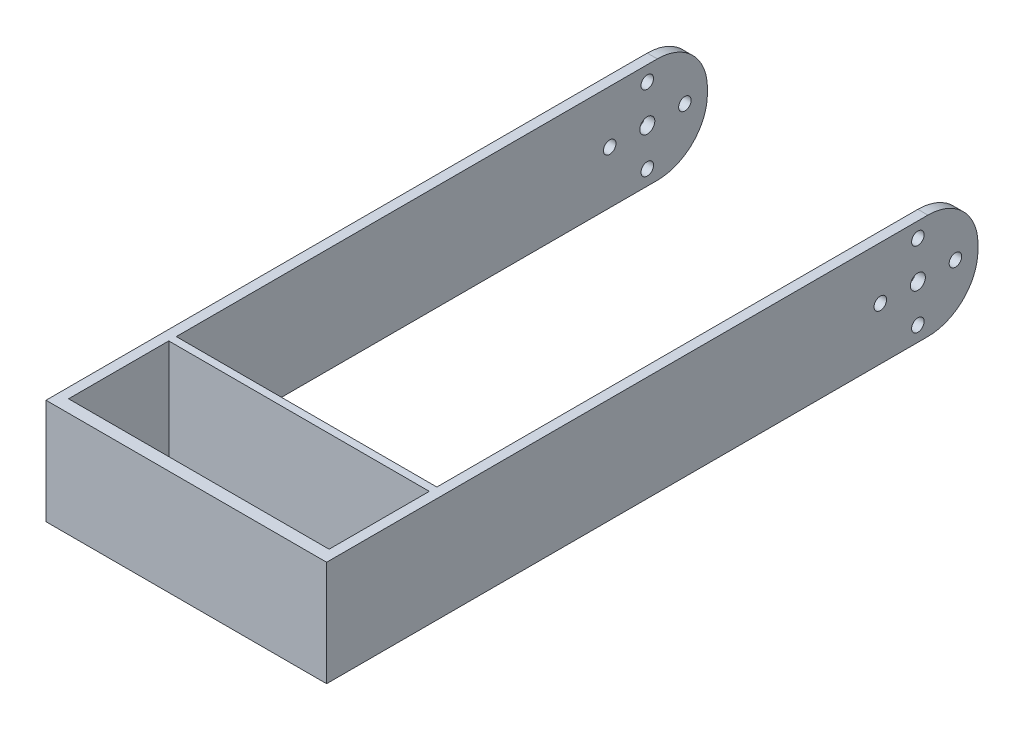
ISO-10303-21;
HEADER;
FILE_DESCRIPTION(('STEP AP214'),'2;1');
FILE_NAME('part.step','',(''),(''),'','','');
FILE_SCHEMA(('AUTOMOTIVE_DESIGN { 1 0 10303 214 1 1 1 1 }'));
ENDSEC;
DATA;
#1=APPLICATION_CONTEXT('core data for automotive mechanical design processes');
#2=APPLICATION_PROTOCOL_DEFINITION('international standard','automotive_design',2000,#1);
#3=PRODUCT_CONTEXT('',#1,'mechanical');
#4=PRODUCT('Part','Part','',(#3));
#5=PRODUCT_RELATED_PRODUCT_CATEGORY('part','',(#4));
#6=PRODUCT_DEFINITION_FORMATION('','',#4);
#7=PRODUCT_DEFINITION_CONTEXT('part definition',#1,'design');
#8=PRODUCT_DEFINITION('design','',#6,#7);
#9=PRODUCT_DEFINITION_SHAPE('','',#8);
#10=(LENGTH_UNIT() NAMED_UNIT(*) SI_UNIT(.MILLI.,.METRE.));
#11=(NAMED_UNIT(*) PLANE_ANGLE_UNIT() SI_UNIT($,.RADIAN.));
#12=(NAMED_UNIT(*) SI_UNIT($,.STERADIAN.) SOLID_ANGLE_UNIT());
#13=UNCERTAINTY_MEASURE_WITH_UNIT(LENGTH_MEASURE(1.E-05),#10,'distance_accuracy_value','');
#14=(GEOMETRIC_REPRESENTATION_CONTEXT(3) GLOBAL_UNCERTAINTY_ASSIGNED_CONTEXT((#13)) GLOBAL_UNIT_ASSIGNED_CONTEXT((#10,
#11,#12)) REPRESENTATION_CONTEXT('',''));
#15=CARTESIAN_POINT('',(0.,0.,0.));
#16=DIRECTION('',(0.,0.,1.));
#17=DIRECTION('',(1.,0.,0.));
#18=AXIS2_PLACEMENT_3D('',#15,#16,#17);
#19=CARTESIAN_POINT('',(0.,0.,0.));
#20=DIRECTION('',(0.,0.,1.));
#21=DIRECTION('',(1.,0.,0.));
#22=AXIS2_PLACEMENT_3D('',#19,#20,#21);
#23=PLANE('',#22);
#24=DIRECTION('',(0.,-1.,0.));
#25=VECTOR('',#24,1.);
#26=CARTESIAN_POINT('',(-28.,10.5,0.));
#27=LINE('',#26,#25);
#28=CARTESIAN_POINT('',(-28.,0.500000000000007,0.));
#29=VERTEX_POINT('',#28);
#30=CARTESIAN_POINT('',(-28.,-0.499999999999994,0.));
#31=VERTEX_POINT('',#30);
#32=EDGE_CURVE('E223',#29,#31,#27,.T.);
#33=ORIENTED_EDGE('',*,*,#32,.F.);
#34=DIRECTION('',(-1.,0.,0.));
#35=VECTOR('',#34,1.);
#36=CARTESIAN_POINT('',(0.,0.500000000000004,0.));
#37=LINE('',#36,#35);
#38=CARTESIAN_POINT('',(-26.,0.500000000000007,0.));
#39=VERTEX_POINT('',#38);
#40=EDGE_CURVE('E54',#29,#39,#37,.F.);
#41=ORIENTED_EDGE('',*,*,#40,.T.);
#42=DIRECTION('',(0.,-1.,0.));
#43=VECTOR('',#42,1.);
#44=CARTESIAN_POINT('',(-26.,10.5,0.));
#45=LINE('',#44,#43);
#46=CARTESIAN_POINT('',(-26.,-0.499999999999994,0.));
#47=VERTEX_POINT('',#46);
#48=EDGE_CURVE('E181',#39,#47,#45,.T.);
#49=ORIENTED_EDGE('',*,*,#48,.T.);
#50=DIRECTION('',(1.,0.,0.));
#51=VECTOR('',#50,1.);
#52=CARTESIAN_POINT('',(0.,-0.499999999999997,0.));
#53=LINE('',#52,#51);
#54=EDGE_CURVE('E290',#47,#31,#53,.F.);
#55=ORIENTED_EDGE('',*,*,#54,.T.);
#56=EDGE_LOOP('',(#33,#41,#49,#55));
#57=FACE_BOUND('',#56,.T.);
#58=ADVANCED_FACE('F33',(#57),#23,.F.);
#59=CARTESIAN_POINT('',(28.,10.5,130.));
#60=DIRECTION('',(-1.,0.,0.));
#61=DIRECTION('',(0.,0.,1.));
#62=AXIS2_PLACEMENT_3D('',#59,#60,#61);
#63=PLANE('',#62);
#64=CARTESIAN_POINT('',(28.,0.,4.5));
#65=DIRECTION('',(1.,0.,0.));
#66=DIRECTION('',(0.,0.,-1.));
#67=AXIS2_PLACEMENT_3D('',#64,#65,#66);
#68=CIRCLE('',#67,1.25);
#69=CARTESIAN_POINT('',(28.,0.,3.25));
#70=VERTEX_POINT('',#69);
#71=EDGE_CURVE('E600',#70,#70,#68,.T.);
#72=ORIENTED_EDGE('',*,*,#71,.F.);
#73=EDGE_LOOP('',(#72));
#74=FACE_BOUND('',#73,.T.);
#75=CARTESIAN_POINT('',(28.,0.,19.5));
#76=DIRECTION('',(1.,0.,0.));
#77=DIRECTION('',(0.,0.,1.));
#78=AXIS2_PLACEMENT_3D('',#75,#76,#77);
#79=CIRCLE('',#78,1.25);
#80=CARTESIAN_POINT('',(28.,0.,20.75));
#81=VERTEX_POINT('',#80);
#82=EDGE_CURVE('E626',#81,#81,#79,.T.);
#83=ORIENTED_EDGE('',*,*,#82,.F.);
#84=EDGE_LOOP('',(#83));
#85=FACE_BOUND('',#84,.T.);
#86=CARTESIAN_POINT('',(28.,7.5,12.));
#87=DIRECTION('',(1.,0.,0.));
#88=DIRECTION('',(0.,0.,-1.));
#89=AXIS2_PLACEMENT_3D('',#86,#87,#88);
#90=CIRCLE('',#89,1.25);
#91=CARTESIAN_POINT('',(28.,7.5,10.75));
#92=VERTEX_POINT('',#91);
#93=EDGE_CURVE('E641',#92,#92,#90,.T.);
#94=ORIENTED_EDGE('',*,*,#93,.F.);
#95=EDGE_LOOP('',(#94));
#96=FACE_BOUND('',#95,.T.);
#97=CARTESIAN_POINT('',(28.,-7.5,12.));
#98=DIRECTION('',(1.,0.,0.));
#99=DIRECTION('',(0.,0.,1.));
#100=AXIS2_PLACEMENT_3D('',#97,#98,#99);
#101=CIRCLE('',#100,1.25);
#102=CARTESIAN_POINT('',(28.,-7.5,13.25));
#103=VERTEX_POINT('',#102);
#104=EDGE_CURVE('E635',#103,#103,#101,.T.);
#105=ORIENTED_EDGE('',*,*,#104,.F.);
#106=EDGE_LOOP('',(#105));
#107=FACE_BOUND('',#106,.T.);
#108=CARTESIAN_POINT('',(28.,0.,12.));
#109=DIRECTION('',(1.,0.,0.));
#110=DIRECTION('',(0.,0.,-1.));
#111=AXIS2_PLACEMENT_3D('',#108,#109,#110);
#112=CIRCLE('',#111,1.5);
#113=CARTESIAN_POINT('',(28.,0.,10.5));
#114=VERTEX_POINT('',#113);
#115=EDGE_CURVE('E591',#114,#114,#112,.T.);
#116=ORIENTED_EDGE('',*,*,#115,.F.);
#117=EDGE_LOOP('',(#116));
#118=FACE_BOUND('',#117,.T.);
#119=DIRECTION('',(0.,1.,0.));
#120=VECTOR('',#119,1.);
#121=CARTESIAN_POINT('',(28.,10.5,0.));
#122=LINE('',#121,#120);
#123=CARTESIAN_POINT('',(28.,-0.499999999999994,0.));
#124=VERTEX_POINT('',#123);
#125=CARTESIAN_POINT('',(28.,0.500000000000007,0.));
#126=VERTEX_POINT('',#125);
#127=EDGE_CURVE('E183',#124,#126,#122,.T.);
#128=ORIENTED_EDGE('',*,*,#127,.T.);
#129=CARTESIAN_POINT('',(28.,0.500000000000004,9.99999999999999));
#130=DIRECTION('',(-1.,0.,0.));
#131=DIRECTION('',(0.,0.,1.));
#132=AXIS2_PLACEMENT_3D('',#129,#130,#131);
#133=CIRCLE('',#132,10.);
#134=CARTESIAN_POINT('',(28.,10.5,9.99999999999999));
#135=VERTEX_POINT('',#134);
#136=EDGE_CURVE('E278',#126,#135,#133,.F.);
#137=ORIENTED_EDGE('',*,*,#136,.T.);
#138=DIRECTION('',(0.,0.,-1.));
#139=VECTOR('',#138,1.);
#140=CARTESIAN_POINT('',(28.,10.5,130.));
#141=LINE('',#140,#139);
#142=CARTESIAN_POINT('',(28.,10.5,130.));
#143=VERTEX_POINT('',#142);
#144=EDGE_CURVE('E242',#143,#135,#141,.T.);
#145=ORIENTED_EDGE('',*,*,#144,.F.);
#146=DIRECTION('',(0.,1.,0.));
#147=VECTOR('',#146,1.);
#148=CARTESIAN_POINT('',(28.,10.5,130.));
#149=LINE('',#148,#147);
#150=CARTESIAN_POINT('',(28.,-10.5,130.));
#151=VERTEX_POINT('',#150);
#152=EDGE_CURVE('E219',#151,#143,#149,.T.);
#153=ORIENTED_EDGE('',*,*,#152,.F.);
#154=DIRECTION('',(0.,0.,-1.));
#155=VECTOR('',#154,1.);
#156=CARTESIAN_POINT('',(28.,-10.5,130.));
#157=LINE('',#156,#155);
#158=CARTESIAN_POINT('',(28.,-10.5,9.99999999999999));
#159=VERTEX_POINT('',#158);
#160=EDGE_CURVE('E229',#151,#159,#157,.T.);
#161=ORIENTED_EDGE('',*,*,#160,.T.);
#162=CARTESIAN_POINT('',(28.,-0.499999999999997,9.99999999999999));
#163=DIRECTION('',(-1.,0.,0.));
#164=DIRECTION('',(0.,0.,1.));
#165=AXIS2_PLACEMENT_3D('',#162,#163,#164);
#166=CIRCLE('',#165,10.);
#167=EDGE_CURVE('E276',#159,#124,#166,.F.);
#168=ORIENTED_EDGE('',*,*,#167,.T.);
#169=EDGE_LOOP('',(#128,#137,#145,#153,#161,#168));
#170=FACE_BOUND('',#169,.T.);
#171=ADVANCED_FACE('F312',(#74,#85,#96,#107,#118,#170),#63,.F.);
#172=CARTESIAN_POINT('',(-28.,10.5,130.));
#173=DIRECTION('',(0.,-1.,0.));
#174=DIRECTION('',(0.,0.,-1.));
#175=AXIS2_PLACEMENT_3D('',#172,#173,#174);
#176=PLANE('',#175);
#177=DIRECTION('',(0.,0.,1.));
#178=VECTOR('',#177,1.);
#179=CARTESIAN_POINT('',(26.,10.5,107.5));
#180=LINE('',#179,#178);
#181=CARTESIAN_POINT('',(26.,10.5,107.5));
#182=VERTEX_POINT('',#181);
#183=CARTESIAN_POINT('',(26.,10.5,127.5));
#184=VERTEX_POINT('',#183);
#185=EDGE_CURVE('E197',#182,#184,#180,.T.);
#186=ORIENTED_EDGE('',*,*,#185,.T.);
#187=DIRECTION('',(-1.,0.,0.));
#188=VECTOR('',#187,1.);
#189=CARTESIAN_POINT('',(26.,10.5,127.5));
#190=LINE('',#189,#188);
#191=CARTESIAN_POINT('',(-26.,10.5,127.5));
#192=VERTEX_POINT('',#191);
#193=EDGE_CURVE('E187',#184,#192,#190,.T.);
#194=ORIENTED_EDGE('',*,*,#193,.T.);
#195=DIRECTION('',(0.,0.,-1.));
#196=VECTOR('',#195,1.);
#197=CARTESIAN_POINT('',(-26.,10.5,127.5));
#198=LINE('',#197,#196);
#199=CARTESIAN_POINT('',(-26.,10.5,107.5));
#200=VERTEX_POINT('',#199);
#201=EDGE_CURVE('E190',#192,#200,#198,.T.);
#202=ORIENTED_EDGE('',*,*,#201,.T.);
#203=DIRECTION('',(1.,0.,0.));
#204=VECTOR('',#203,1.);
#205=CARTESIAN_POINT('',(-26.,10.5,107.5));
#206=LINE('',#205,#204);
#207=EDGE_CURVE('E194',#200,#182,#206,.T.);
#208=ORIENTED_EDGE('',*,*,#207,.T.);
#209=EDGE_LOOP('',(#186,#194,#202,#208));
#210=FACE_BOUND('',#209,.T.);
#211=ORIENTED_EDGE('',*,*,#144,.T.);
#212=DIRECTION('',(-1.,0.,0.));
#213=VECTOR('',#212,1.);
#214=CARTESIAN_POINT('',(-28.,10.5,9.99999999999999));
#215=LINE('',#214,#213);
#216=CARTESIAN_POINT('',(26.,10.5,9.99999999999999));
#217=VERTEX_POINT('',#216);
#218=EDGE_CURVE('E154',#135,#217,#215,.T.);
#219=ORIENTED_EDGE('',*,*,#218,.T.);
#220=DIRECTION('',(0.,0.,1.));
#221=VECTOR('',#220,1.);
#222=CARTESIAN_POINT('',(26.,10.5,0.));
#223=LINE('',#222,#221);
#224=CARTESIAN_POINT('',(26.,10.5,106.));
#225=VERTEX_POINT('',#224);
#226=EDGE_CURVE('E146',#217,#225,#223,.T.);
#227=ORIENTED_EDGE('',*,*,#226,.T.);
#228=DIRECTION('',(-1.,0.,0.));
#229=VECTOR('',#228,1.);
#230=CARTESIAN_POINT('',(-26.,10.5,106.));
#231=LINE('',#230,#229);
#232=CARTESIAN_POINT('',(-26.,10.5,106.));
#233=VERTEX_POINT('',#232);
#234=EDGE_CURVE('E152',#225,#233,#231,.T.);
#235=ORIENTED_EDGE('',*,*,#234,.T.);
#236=DIRECTION('',(0.,0.,-1.));
#237=VECTOR('',#236,1.);
#238=CARTESIAN_POINT('',(-26.,10.5,106.));
#239=LINE('',#238,#237);
#240=CARTESIAN_POINT('',(-26.,10.5,9.99999999999999));
#241=VERTEX_POINT('',#240);
#242=EDGE_CURVE('E171',#233,#241,#239,.T.);
#243=ORIENTED_EDGE('',*,*,#242,.T.);
#244=DIRECTION('',(-1.,0.,0.));
#245=VECTOR('',#244,1.);
#246=CARTESIAN_POINT('',(-28.,10.5,9.99999999999999));
#247=LINE('',#246,#245);
#248=CARTESIAN_POINT('',(-28.,10.5,9.99999999999999));
#249=VERTEX_POINT('',#248);
#250=EDGE_CURVE('E244',#241,#249,#247,.T.);
#251=ORIENTED_EDGE('',*,*,#250,.T.);
#252=DIRECTION('',(0.,0.,-1.));
#253=VECTOR('',#252,1.);
#254=CARTESIAN_POINT('',(-28.,10.5,130.));
#255=LINE('',#254,#253);
#256=CARTESIAN_POINT('',(-28.,10.5,130.));
#257=VERTEX_POINT('',#256);
#258=EDGE_CURVE('E239',#257,#249,#255,.T.);
#259=ORIENTED_EDGE('',*,*,#258,.F.);
#260=DIRECTION('',(-1.,0.,0.));
#261=VECTOR('',#260,1.);
#262=CARTESIAN_POINT('',(-28.,10.5,130.));
#263=LINE('',#262,#261);
#264=EDGE_CURVE('E222',#143,#257,#263,.T.);
#265=ORIENTED_EDGE('',*,*,#264,.F.);
#266=EDGE_LOOP('',(#211,#219,#227,#235,#243,#251,#259,#265));
#267=FACE_BOUND('',#266,.T.);
#268=ADVANCED_FACE('F149',(#210,#267),#176,.F.);
#269=CARTESIAN_POINT('',(-28.,10.5,130.));
#270=DIRECTION('',(1.,0.,0.));
#271=DIRECTION('',(0.,1.,0.));
#272=AXIS2_PLACEMENT_3D('',#269,#270,#271);
#273=PLANE('',#272);
#274=CARTESIAN_POINT('',(-28.,0.,4.5));
#275=DIRECTION('',(1.,0.,0.));
#276=DIRECTION('',(0.,0.,-1.));
#277=AXIS2_PLACEMENT_3D('',#274,#275,#276);
#278=CIRCLE('',#277,1.25);
#279=CARTESIAN_POINT('',(-28.,0.,3.25));
#280=VERTEX_POINT('',#279);
#281=EDGE_CURVE('E595',#280,#280,#278,.T.);
#282=ORIENTED_EDGE('',*,*,#281,.T.);
#283=EDGE_LOOP('',(#282));
#284=FACE_BOUND('',#283,.T.);
#285=CARTESIAN_POINT('',(-28.,0.,19.5));
#286=DIRECTION('',(1.,0.,0.));
#287=DIRECTION('',(0.,0.,1.));
#288=AXIS2_PLACEMENT_3D('',#285,#286,#287);
#289=CIRCLE('',#288,1.25);
#290=CARTESIAN_POINT('',(-28.,0.,20.75));
#291=VERTEX_POINT('',#290);
#292=EDGE_CURVE('E629',#291,#291,#289,.T.);
#293=ORIENTED_EDGE('',*,*,#292,.T.);
#294=EDGE_LOOP('',(#293));
#295=FACE_BOUND('',#294,.T.);
#296=CARTESIAN_POINT('',(-28.,7.5,12.));
#297=DIRECTION('',(1.,0.,0.));
#298=DIRECTION('',(0.,0.,-1.));
#299=AXIS2_PLACEMENT_3D('',#296,#297,#298);
#300=CIRCLE('',#299,1.25);
#301=CARTESIAN_POINT('',(-28.,7.5,10.75));
#302=VERTEX_POINT('',#301);
#303=EDGE_CURVE('E630',#302,#302,#300,.T.);
#304=ORIENTED_EDGE('',*,*,#303,.T.);
#305=EDGE_LOOP('',(#304));
#306=FACE_BOUND('',#305,.T.);
#307=CARTESIAN_POINT('',(-28.,-7.5,12.));
#308=DIRECTION('',(1.,0.,0.));
#309=DIRECTION('',(0.,0.,1.));
#310=AXIS2_PLACEMENT_3D('',#307,#308,#309);
#311=CIRCLE('',#310,1.25);
#312=CARTESIAN_POINT('',(-28.,-7.5,13.25));
#313=VERTEX_POINT('',#312);
#314=EDGE_CURVE('E638',#313,#313,#311,.T.);
#315=ORIENTED_EDGE('',*,*,#314,.T.);
#316=EDGE_LOOP('',(#315));
#317=FACE_BOUND('',#316,.T.);
#318=CARTESIAN_POINT('',(-28.,0.,12.));
#319=DIRECTION('',(1.,0.,0.));
#320=DIRECTION('',(0.,0.,-1.));
#321=AXIS2_PLACEMENT_3D('',#318,#319,#320);
#322=CIRCLE('',#321,1.5);
#323=CARTESIAN_POINT('',(-28.,0.,10.5));
#324=VERTEX_POINT('',#323);
#325=EDGE_CURVE('E249',#324,#324,#322,.T.);
#326=ORIENTED_EDGE('',*,*,#325,.T.);
#327=EDGE_LOOP('',(#326));
#328=FACE_BOUND('',#327,.T.);
#329=ORIENTED_EDGE('',*,*,#258,.T.);
#330=CARTESIAN_POINT('',(-28.,0.500000000000004,9.99999999999999));
#331=DIRECTION('',(1.,0.,0.));
#332=DIRECTION('',(0.,1.,0.));
#333=AXIS2_PLACEMENT_3D('',#330,#331,#332);
#334=CIRCLE('',#333,10.);
#335=EDGE_CURVE('E288',#249,#29,#334,.F.);
#336=ORIENTED_EDGE('',*,*,#335,.T.);
#337=ORIENTED_EDGE('',*,*,#32,.T.);
#338=CARTESIAN_POINT('',(-28.,-0.499999999999997,9.99999999999999));
#339=DIRECTION('',(1.,0.,0.));
#340=DIRECTION('',(0.,1.,0.));
#341=AXIS2_PLACEMENT_3D('',#338,#339,#340);
#342=CIRCLE('',#341,10.);
#343=CARTESIAN_POINT('',(-28.,-10.5,9.99999999999999));
#344=VERTEX_POINT('',#343);
#345=EDGE_CURVE('E286',#31,#344,#342,.F.);
#346=ORIENTED_EDGE('',*,*,#345,.T.);
#347=DIRECTION('',(0.,0.,-1.));
#348=VECTOR('',#347,1.);
#349=CARTESIAN_POINT('',(-28.,-10.5,130.));
#350=LINE('',#349,#348);
#351=CARTESIAN_POINT('',(-28.,-10.5,130.));
#352=VERTEX_POINT('',#351);
#353=EDGE_CURVE('E236',#352,#344,#350,.T.);
#354=ORIENTED_EDGE('',*,*,#353,.F.);
#355=DIRECTION('',(0.,-1.,0.));
#356=VECTOR('',#355,1.);
#357=CARTESIAN_POINT('',(-28.,10.5,130.));
#358=LINE('',#357,#356);
#359=EDGE_CURVE('E225',#257,#352,#358,.T.);
#360=ORIENTED_EDGE('',*,*,#359,.F.);
#361=EDGE_LOOP('',(#329,#336,#337,#346,#354,#360));
#362=FACE_BOUND('',#361,.T.);
#363=ADVANCED_FACE('F296',(#284,#295,#306,#317,#328,#362),#273,.F.);
#364=CARTESIAN_POINT('',(-28.,-10.5,130.));
#365=DIRECTION('',(0.,1.,0.));
#366=DIRECTION('',(0.,0.,1.));
#367=AXIS2_PLACEMENT_3D('',#364,#365,#366);
#368=PLANE('',#367);
#369=DIRECTION('',(0.,0.,-1.));
#370=VECTOR('',#369,1.);
#371=CARTESIAN_POINT('',(-26.,-10.5,127.5));
#372=LINE('',#371,#370);
#373=CARTESIAN_POINT('',(-26.,-10.5,127.5));
#374=VERTEX_POINT('',#373);
#375=CARTESIAN_POINT('',(-26.,-10.5,107.5));
#376=VERTEX_POINT('',#375);
#377=EDGE_CURVE('E203',#374,#376,#372,.T.);
#378=ORIENTED_EDGE('',*,*,#377,.F.);
#379=DIRECTION('',(-1.,0.,0.));
#380=VECTOR('',#379,1.);
#381=CARTESIAN_POINT('',(26.,-10.5,127.5));
#382=LINE('',#381,#380);
#383=CARTESIAN_POINT('',(26.,-10.5,127.5));
#384=VERTEX_POINT('',#383);
#385=EDGE_CURVE('E201',#384,#374,#382,.T.);
#386=ORIENTED_EDGE('',*,*,#385,.F.);
#387=DIRECTION('',(0.,0.,1.));
#388=VECTOR('',#387,1.);
#389=CARTESIAN_POINT('',(26.,-10.5,107.5));
#390=LINE('',#389,#388);
#391=CARTESIAN_POINT('',(26.,-10.5,107.5));
#392=VERTEX_POINT('',#391);
#393=EDGE_CURVE('E191',#392,#384,#390,.T.);
#394=ORIENTED_EDGE('',*,*,#393,.F.);
#395=DIRECTION('',(1.,0.,0.));
#396=VECTOR('',#395,1.);
#397=CARTESIAN_POINT('',(-26.,-10.5,107.5));
#398=LINE('',#397,#396);
#399=EDGE_CURVE('E207',#376,#392,#398,.T.);
#400=ORIENTED_EDGE('',*,*,#399,.F.);
#401=EDGE_LOOP('',(#378,#386,#394,#400));
#402=FACE_BOUND('',#401,.T.);
#403=DIRECTION('',(0.,0.,1.));
#404=VECTOR('',#403,1.);
#405=CARTESIAN_POINT('',(26.,-10.5,0.));
#406=LINE('',#405,#404);
#407=CARTESIAN_POINT('',(26.,-10.5,9.99999999999999));
#408=VERTEX_POINT('',#407);
#409=CARTESIAN_POINT('',(26.,-10.5,106.));
#410=VERTEX_POINT('',#409);
#411=EDGE_CURVE('E162',#408,#410,#406,.T.);
#412=ORIENTED_EDGE('',*,*,#411,.F.);
#413=DIRECTION('',(1.,0.,0.));
#414=VECTOR('',#413,1.);
#415=CARTESIAN_POINT('',(-28.,-10.5,9.99999999999999));
#416=LINE('',#415,#414);
#417=EDGE_CURVE('E283',#408,#159,#416,.T.);
#418=ORIENTED_EDGE('',*,*,#417,.T.);
#419=ORIENTED_EDGE('',*,*,#160,.F.);
#420=DIRECTION('',(1.,0.,0.));
#421=VECTOR('',#420,1.);
#422=CARTESIAN_POINT('',(-28.,-10.5,130.));
#423=LINE('',#422,#421);
#424=EDGE_CURVE('E227',#352,#151,#423,.T.);
#425=ORIENTED_EDGE('',*,*,#424,.F.);
#426=ORIENTED_EDGE('',*,*,#353,.T.);
#427=DIRECTION('',(1.,0.,0.));
#428=VECTOR('',#427,1.);
#429=CARTESIAN_POINT('',(-28.,-10.5,9.99999999999999));
#430=LINE('',#429,#428);
#431=CARTESIAN_POINT('',(-26.,-10.5,9.99999999999999));
#432=VERTEX_POINT('',#431);
#433=EDGE_CURVE('E280',#344,#432,#430,.T.);
#434=ORIENTED_EDGE('',*,*,#433,.T.);
#435=DIRECTION('',(0.,0.,-1.));
#436=VECTOR('',#435,1.);
#437=CARTESIAN_POINT('',(-26.,-10.5,106.));
#438=LINE('',#437,#436);
#439=CARTESIAN_POINT('',(-26.,-10.5,106.));
#440=VERTEX_POINT('',#439);
#441=EDGE_CURVE('E156',#440,#432,#438,.T.);
#442=ORIENTED_EDGE('',*,*,#441,.F.);
#443=DIRECTION('',(-1.,0.,0.));
#444=VECTOR('',#443,1.);
#445=CARTESIAN_POINT('',(-26.,-10.5,106.));
#446=LINE('',#445,#444);
#447=EDGE_CURVE('E177',#410,#440,#446,.T.);
#448=ORIENTED_EDGE('',*,*,#447,.F.);
#449=EDGE_LOOP('',(#412,#418,#419,#425,#426,#434,#442,#448));
#450=FACE_BOUND('',#449,.T.);
#451=ADVANCED_FACE('F301',(#402,#450),#368,.F.);
#452=CARTESIAN_POINT('',(0.,0.,130.));
#453=DIRECTION('',(0.,0.,1.));
#454=DIRECTION('',(1.,0.,0.));
#455=AXIS2_PLACEMENT_3D('',#452,#453,#454);
#456=PLANE('',#455);
#457=ORIENTED_EDGE('',*,*,#152,.T.);
#458=ORIENTED_EDGE('',*,*,#264,.T.);
#459=ORIENTED_EDGE('',*,*,#359,.T.);
#460=ORIENTED_EDGE('',*,*,#424,.T.);
#461=EDGE_LOOP('',(#457,#458,#459,#460));
#462=FACE_BOUND('',#461,.T.);
#463=ADVANCED_FACE('F325',(#462),#456,.T.);
#464=DIRECTION('',(0.,-1.,0.));
#465=VECTOR('',#464,1.);
#466=CARTESIAN_POINT('',(26.,10.5,0.));
#467=LINE('',#466,#465);
#468=CARTESIAN_POINT('',(26.,0.500000000000007,0.));
#469=VERTEX_POINT('',#468);
#470=CARTESIAN_POINT('',(26.,-0.499999999999994,0.));
#471=VERTEX_POINT('',#470);
#472=EDGE_CURVE('E167',#469,#471,#467,.T.);
#473=ORIENTED_EDGE('',*,*,#472,.F.);
#474=DIRECTION('',(-1.,0.,0.));
#475=VECTOR('',#474,1.);
#476=CARTESIAN_POINT('',(0.,0.500000000000004,0.));
#477=LINE('',#476,#475);
#478=EDGE_CURVE('E274',#469,#126,#477,.F.);
#479=ORIENTED_EDGE('',*,*,#478,.T.);
#480=ORIENTED_EDGE('',*,*,#127,.F.);
#481=DIRECTION('',(1.,0.,0.));
#482=VECTOR('',#481,1.);
#483=CARTESIAN_POINT('',(0.,-0.499999999999997,0.));
#484=LINE('',#483,#482);
#485=EDGE_CURVE('E272',#124,#471,#484,.F.);
#486=ORIENTED_EDGE('',*,*,#485,.T.);
#487=EDGE_LOOP('',(#473,#479,#480,#486));
#488=FACE_BOUND('',#487,.T.);
#489=ADVANCED_FACE('F317',(#488),#23,.F.);
#490=CARTESIAN_POINT('',(-26.,10.5,106.));
#491=DIRECTION('',(-1.,0.,0.));
#492=DIRECTION('',(0.,0.,1.));
#493=AXIS2_PLACEMENT_3D('',#490,#491,#492);
#494=PLANE('',#493);
#495=CARTESIAN_POINT('',(-26.,0.,4.5));
#496=DIRECTION('',(-1.,0.,0.));
#497=DIRECTION('',(0.,0.,1.));
#498=AXIS2_PLACEMENT_3D('',#495,#496,#497);
#499=CIRCLE('',#498,1.25);
#500=CARTESIAN_POINT('',(-26.,0.,5.75));
#501=VERTEX_POINT('',#500);
#502=EDGE_CURVE('E204',#501,#501,#499,.T.);
#503=ORIENTED_EDGE('',*,*,#502,.T.);
#504=EDGE_LOOP('',(#503));
#505=FACE_BOUND('',#504,.T.);
#506=CARTESIAN_POINT('',(-26.,0.,19.5));
#507=DIRECTION('',(-1.,0.,0.));
#508=DIRECTION('',(0.,0.,1.));
#509=AXIS2_PLACEMENT_3D('',#506,#507,#508);
#510=CIRCLE('',#509,1.25);
#511=CARTESIAN_POINT('',(-26.,0.,20.75));
#512=VERTEX_POINT('',#511);
#513=EDGE_CURVE('E261',#512,#512,#510,.T.);
#514=ORIENTED_EDGE('',*,*,#513,.T.);
#515=EDGE_LOOP('',(#514));
#516=FACE_BOUND('',#515,.T.);
#517=CARTESIAN_POINT('',(-26.,7.5,12.));
#518=DIRECTION('',(-1.,0.,0.));
#519=DIRECTION('',(0.,0.,1.));
#520=AXIS2_PLACEMENT_3D('',#517,#518,#519);
#521=CIRCLE('',#520,1.25);
#522=CARTESIAN_POINT('',(-26.,7.5,13.25));
#523=VERTEX_POINT('',#522);
#524=EDGE_CURVE('E257',#523,#523,#521,.T.);
#525=ORIENTED_EDGE('',*,*,#524,.T.);
#526=EDGE_LOOP('',(#525));
#527=FACE_BOUND('',#526,.T.);
#528=CARTESIAN_POINT('',(-26.,-7.5,12.));
#529=DIRECTION('',(-1.,0.,0.));
#530=DIRECTION('',(0.,0.,1.));
#531=AXIS2_PLACEMENT_3D('',#528,#529,#530);
#532=CIRCLE('',#531,1.25);
#533=CARTESIAN_POINT('',(-26.,-7.5,13.25));
#534=VERTEX_POINT('',#533);
#535=EDGE_CURVE('E253',#534,#534,#532,.T.);
#536=ORIENTED_EDGE('',*,*,#535,.T.);
#537=EDGE_LOOP('',(#536));
#538=FACE_BOUND('',#537,.T.);
#539=CARTESIAN_POINT('',(-26.,0.,12.));
#540=DIRECTION('',(-1.,0.,0.));
#541=DIRECTION('',(0.,0.,1.));
#542=AXIS2_PLACEMENT_3D('',#539,#540,#541);
#543=CIRCLE('',#542,1.5);
#544=CARTESIAN_POINT('',(-26.,0.,13.5));
#545=VERTEX_POINT('',#544);
#546=EDGE_CURVE('E248',#545,#545,#543,.T.);
#547=ORIENTED_EDGE('',*,*,#546,.T.);
#548=EDGE_LOOP('',(#547));
#549=FACE_BOUND('',#548,.T.);
#550=ORIENTED_EDGE('',*,*,#48,.F.);
#551=CARTESIAN_POINT('',(-26.,0.500000000000004,9.99999999999999));
#552=DIRECTION('',(-1.,0.,0.));
#553=DIRECTION('',(0.,0.,1.));
#554=AXIS2_PLACEMENT_3D('',#551,#552,#553);
#555=CIRCLE('',#554,10.);
#556=EDGE_CURVE('E11',#39,#241,#555,.F.);
#557=ORIENTED_EDGE('',*,*,#556,.T.);
#558=ORIENTED_EDGE('',*,*,#242,.F.);
#559=DIRECTION('',(0.,-1.,0.));
#560=VECTOR('',#559,1.);
#561=CARTESIAN_POINT('',(-26.,10.5,106.));
#562=LINE('',#561,#560);
#563=EDGE_CURVE('E166',#233,#440,#562,.T.);
#564=ORIENTED_EDGE('',*,*,#563,.T.);
#565=ORIENTED_EDGE('',*,*,#441,.T.);
#566=CARTESIAN_POINT('',(-26.,-0.499999999999997,9.99999999999999));
#567=DIRECTION('',(-1.,0.,0.));
#568=DIRECTION('',(0.,0.,1.));
#569=AXIS2_PLACEMENT_3D('',#566,#567,#568);
#570=CIRCLE('',#569,10.);
#571=EDGE_CURVE('E41',#432,#47,#570,.F.);
#572=ORIENTED_EDGE('',*,*,#571,.T.);
#573=EDGE_LOOP('',(#550,#557,#558,#564,#565,#572));
#574=FACE_BOUND('',#573,.T.);
#575=ADVANCED_FACE('F303',(#505,#516,#527,#538,#549,#574),#494,.F.);
#576=CARTESIAN_POINT('',(-26.,10.5,106.));
#577=DIRECTION('',(0.,0.,1.));
#578=DIRECTION('',(1.,0.,0.));
#579=AXIS2_PLACEMENT_3D('',#576,#577,#578);
#580=PLANE('',#579);
#581=ORIENTED_EDGE('',*,*,#447,.T.);
#582=ORIENTED_EDGE('',*,*,#563,.F.);
#583=ORIENTED_EDGE('',*,*,#234,.F.);
#584=DIRECTION('',(0.,-1.,0.));
#585=VECTOR('',#584,1.);
#586=CARTESIAN_POINT('',(26.,10.5,106.));
#587=LINE('',#586,#585);
#588=EDGE_CURVE('E159',#225,#410,#587,.T.);
#589=ORIENTED_EDGE('',*,*,#588,.T.);
#590=EDGE_LOOP('',(#581,#582,#583,#589));
#591=FACE_BOUND('',#590,.T.);
#592=ADVANCED_FACE('F169',(#591),#580,.F.);
#593=CARTESIAN_POINT('',(26.,10.5,0.));
#594=DIRECTION('',(1.,0.,0.));
#595=DIRECTION('',(0.,0.,-1.));
#596=AXIS2_PLACEMENT_3D('',#593,#594,#595);
#597=PLANE('',#596);
#598=CARTESIAN_POINT('',(26.,0.,4.5));
#599=DIRECTION('',(1.,0.,0.));
#600=DIRECTION('',(0.,0.,-1.));
#601=AXIS2_PLACEMENT_3D('',#598,#599,#600);
#602=CIRCLE('',#601,1.25);
#603=CARTESIAN_POINT('',(26.,0.,3.25));
#604=VERTEX_POINT('',#603);
#605=EDGE_CURVE('E262',#604,#604,#602,.T.);
#606=ORIENTED_EDGE('',*,*,#605,.T.);
#607=EDGE_LOOP('',(#606));
#608=FACE_BOUND('',#607,.T.);
#609=CARTESIAN_POINT('',(26.,0.,19.5));
#610=DIRECTION('',(1.,0.,0.));
#611=DIRECTION('',(0.,0.,-1.));
#612=AXIS2_PLACEMENT_3D('',#609,#610,#611);
#613=CIRCLE('',#612,1.25);
#614=CARTESIAN_POINT('',(26.,0.,18.25));
#615=VERTEX_POINT('',#614);
#616=EDGE_CURVE('E258',#615,#615,#613,.T.);
#617=ORIENTED_EDGE('',*,*,#616,.T.);
#618=EDGE_LOOP('',(#617));
#619=FACE_BOUND('',#618,.T.);
#620=CARTESIAN_POINT('',(26.,7.5,12.));
#621=DIRECTION('',(1.,0.,0.));
#622=DIRECTION('',(0.,0.,-1.));
#623=AXIS2_PLACEMENT_3D('',#620,#621,#622);
#624=CIRCLE('',#623,1.25);
#625=CARTESIAN_POINT('',(26.,7.5,10.75));
#626=VERTEX_POINT('',#625);
#627=EDGE_CURVE('E254',#626,#626,#624,.T.);
#628=ORIENTED_EDGE('',*,*,#627,.T.);
#629=EDGE_LOOP('',(#628));
#630=FACE_BOUND('',#629,.T.);
#631=CARTESIAN_POINT('',(26.,-7.5,12.));
#632=DIRECTION('',(1.,0.,0.));
#633=DIRECTION('',(0.,0.,-1.));
#634=AXIS2_PLACEMENT_3D('',#631,#632,#633);
#635=CIRCLE('',#634,1.25);
#636=CARTESIAN_POINT('',(26.,-7.5,10.75));
#637=VERTEX_POINT('',#636);
#638=EDGE_CURVE('E250',#637,#637,#635,.T.);
#639=ORIENTED_EDGE('',*,*,#638,.T.);
#640=EDGE_LOOP('',(#639));
#641=FACE_BOUND('',#640,.T.);
#642=CARTESIAN_POINT('',(26.,0.,12.));
#643=DIRECTION('',(1.,0.,0.));
#644=DIRECTION('',(0.,0.,-1.));
#645=AXIS2_PLACEMENT_3D('',#642,#643,#644);
#646=CIRCLE('',#645,1.5);
#647=CARTESIAN_POINT('',(26.,0.,10.5));
#648=VERTEX_POINT('',#647);
#649=EDGE_CURVE('E245',#648,#648,#646,.T.);
#650=ORIENTED_EDGE('',*,*,#649,.T.);
#651=EDGE_LOOP('',(#650));
#652=FACE_BOUND('',#651,.T.);
#653=ORIENTED_EDGE('',*,*,#226,.F.);
#654=CARTESIAN_POINT('',(26.,0.500000000000004,9.99999999999999));
#655=DIRECTION('',(1.,0.,0.));
#656=DIRECTION('',(0.,0.,-1.));
#657=AXIS2_PLACEMENT_3D('',#654,#655,#656);
#658=CIRCLE('',#657,10.);
#659=EDGE_CURVE('E270',#217,#469,#658,.F.);
#660=ORIENTED_EDGE('',*,*,#659,.T.);
#661=ORIENTED_EDGE('',*,*,#472,.T.);
#662=CARTESIAN_POINT('',(26.,-0.499999999999997,9.99999999999999));
#663=DIRECTION('',(1.,0.,0.));
#664=DIRECTION('',(0.,0.,-1.));
#665=AXIS2_PLACEMENT_3D('',#662,#663,#664);
#666=CIRCLE('',#665,10.);
#667=EDGE_CURVE('E268',#471,#408,#666,.F.);
#668=ORIENTED_EDGE('',*,*,#667,.T.);
#669=ORIENTED_EDGE('',*,*,#411,.T.);
#670=ORIENTED_EDGE('',*,*,#588,.F.);
#671=EDGE_LOOP('',(#653,#660,#661,#668,#669,#670));
#672=FACE_BOUND('',#671,.T.);
#673=ADVANCED_FACE('F160',(#608,#619,#630,#641,#652,#672),#597,.F.);
#674=CARTESIAN_POINT('',(26.,10.5,127.5));
#675=DIRECTION('',(0.,0.,1.));
#676=DIRECTION('',(1.,0.,0.));
#677=AXIS2_PLACEMENT_3D('',#674,#675,#676);
#678=PLANE('',#677);
#679=ORIENTED_EDGE('',*,*,#385,.T.);
#680=DIRECTION('',(0.,-1.,0.));
#681=VECTOR('',#680,1.);
#682=CARTESIAN_POINT('',(-26.,10.5,127.5));
#683=LINE('',#682,#681);
#684=EDGE_CURVE('E200',#192,#374,#683,.T.);
#685=ORIENTED_EDGE('',*,*,#684,.F.);
#686=ORIENTED_EDGE('',*,*,#193,.F.);
#687=DIRECTION('',(0.,-1.,0.));
#688=VECTOR('',#687,1.);
#689=CARTESIAN_POINT('',(26.,10.5,127.5));
#690=LINE('',#689,#688);
#691=EDGE_CURVE('E178',#184,#384,#690,.T.);
#692=ORIENTED_EDGE('',*,*,#691,.T.);
#693=EDGE_LOOP('',(#679,#685,#686,#692));
#694=FACE_BOUND('',#693,.T.);
#695=ADVANCED_FACE('F390',(#694),#678,.F.);
#696=CARTESIAN_POINT('',(26.,10.5,107.5));
#697=DIRECTION('',(1.,0.,0.));
#698=DIRECTION('',(0.,0.,-1.));
#699=AXIS2_PLACEMENT_3D('',#696,#697,#698);
#700=PLANE('',#699);
#701=ORIENTED_EDGE('',*,*,#393,.T.);
#702=ORIENTED_EDGE('',*,*,#691,.F.);
#703=ORIENTED_EDGE('',*,*,#185,.F.);
#704=DIRECTION('',(0.,-1.,0.));
#705=VECTOR('',#704,1.);
#706=CARTESIAN_POINT('',(26.,10.5,107.5));
#707=LINE('',#706,#705);
#708=EDGE_CURVE('E213',#182,#392,#707,.T.);
#709=ORIENTED_EDGE('',*,*,#708,.T.);
#710=EDGE_LOOP('',(#701,#702,#703,#709));
#711=FACE_BOUND('',#710,.T.);
#712=ADVANCED_FACE('F551',(#711),#700,.F.);
#713=CARTESIAN_POINT('',(-26.,10.5,107.5));
#714=DIRECTION('',(0.,0.,-1.));
#715=DIRECTION('',(-1.,0.,0.));
#716=AXIS2_PLACEMENT_3D('',#713,#714,#715);
#717=PLANE('',#716);
#718=ORIENTED_EDGE('',*,*,#399,.T.);
#719=ORIENTED_EDGE('',*,*,#708,.F.);
#720=ORIENTED_EDGE('',*,*,#207,.F.);
#721=DIRECTION('',(0.,-1.,0.));
#722=VECTOR('',#721,1.);
#723=CARTESIAN_POINT('',(-26.,10.5,107.5));
#724=LINE('',#723,#722);
#725=EDGE_CURVE('E215',#200,#376,#724,.T.);
#726=ORIENTED_EDGE('',*,*,#725,.T.);
#727=EDGE_LOOP('',(#718,#719,#720,#726));
#728=FACE_BOUND('',#727,.T.);
#729=ADVANCED_FACE('F541',(#728),#717,.F.);
#730=CARTESIAN_POINT('',(-26.,10.5,127.5));
#731=DIRECTION('',(-1.,0.,0.));
#732=DIRECTION('',(0.,0.,1.));
#733=AXIS2_PLACEMENT_3D('',#730,#731,#732);
#734=PLANE('',#733);
#735=ORIENTED_EDGE('',*,*,#377,.T.);
#736=ORIENTED_EDGE('',*,*,#725,.F.);
#737=ORIENTED_EDGE('',*,*,#201,.F.);
#738=ORIENTED_EDGE('',*,*,#684,.T.);
#739=EDGE_LOOP('',(#735,#736,#737,#738));
#740=FACE_BOUND('',#739,.T.);
#741=ADVANCED_FACE('F532',(#740),#734,.F.);
#742=CARTESIAN_POINT('',(-28.,0.,12.));
#743=DIRECTION('',(1.,0.,0.));
#744=DIRECTION('',(0.,0.,-1.));
#745=AXIS2_PLACEMENT_3D('',#742,#743,#744);
#746=CYLINDRICAL_SURFACE('',#745,1.5);
#747=ORIENTED_EDGE('',*,*,#115,.T.);
#748=EDGE_LOOP('',(#747));
#749=FACE_BOUND('',#748,.T.);
#750=ORIENTED_EDGE('',*,*,#649,.F.);
#751=EDGE_LOOP('',(#750));
#752=FACE_BOUND('',#751,.T.);
#753=ADVANCED_FACE('F492',(#749,#752),#746,.F.);
#754=CARTESIAN_POINT('',(-28.,-7.5,12.));
#755=DIRECTION('',(1.,0.,0.));
#756=DIRECTION('',(0.,0.,-1.));
#757=AXIS2_PLACEMENT_3D('',#754,#755,#756);
#758=CYLINDRICAL_SURFACE('',#757,1.25);
#759=ORIENTED_EDGE('',*,*,#104,.T.);
#760=EDGE_LOOP('',(#759));
#761=FACE_BOUND('',#760,.T.);
#762=ORIENTED_EDGE('',*,*,#638,.F.);
#763=EDGE_LOOP('',(#762));
#764=FACE_BOUND('',#763,.T.);
#765=ADVANCED_FACE('F482',(#761,#764),#758,.F.);
#766=CARTESIAN_POINT('',(-28.,7.5,12.));
#767=DIRECTION('',(1.,0.,0.));
#768=DIRECTION('',(0.,0.,-1.));
#769=AXIS2_PLACEMENT_3D('',#766,#767,#768);
#770=CYLINDRICAL_SURFACE('',#769,1.25);
#771=ORIENTED_EDGE('',*,*,#93,.T.);
#772=EDGE_LOOP('',(#771));
#773=FACE_BOUND('',#772,.T.);
#774=ORIENTED_EDGE('',*,*,#627,.F.);
#775=EDGE_LOOP('',(#774));
#776=FACE_BOUND('',#775,.T.);
#777=ADVANCED_FACE('F471',(#773,#776),#770,.F.);
#778=CARTESIAN_POINT('',(-28.,0.,19.5));
#779=DIRECTION('',(1.,0.,0.));
#780=DIRECTION('',(0.,0.,-1.));
#781=AXIS2_PLACEMENT_3D('',#778,#779,#780);
#782=CYLINDRICAL_SURFACE('',#781,1.25);
#783=ORIENTED_EDGE('',*,*,#82,.T.);
#784=EDGE_LOOP('',(#783));
#785=FACE_BOUND('',#784,.T.);
#786=ORIENTED_EDGE('',*,*,#616,.F.);
#787=EDGE_LOOP('',(#786));
#788=FACE_BOUND('',#787,.T.);
#789=ADVANCED_FACE('F460',(#785,#788),#782,.F.);
#790=CARTESIAN_POINT('',(-28.,0.,4.5));
#791=DIRECTION('',(1.,0.,0.));
#792=DIRECTION('',(0.,0.,-1.));
#793=AXIS2_PLACEMENT_3D('',#790,#791,#792);
#794=CYLINDRICAL_SURFACE('',#793,1.25);
#795=ORIENTED_EDGE('',*,*,#71,.T.);
#796=EDGE_LOOP('',(#795));
#797=FACE_BOUND('',#796,.T.);
#798=ORIENTED_EDGE('',*,*,#605,.F.);
#799=EDGE_LOOP('',(#798));
#800=FACE_BOUND('',#799,.T.);
#801=ADVANCED_FACE('F449',(#797,#800),#794,.F.);
#802=ORIENTED_EDGE('',*,*,#325,.F.);
#803=EDGE_LOOP('',(#802));
#804=FACE_BOUND('',#803,.T.);
#805=ORIENTED_EDGE('',*,*,#546,.F.);
#806=EDGE_LOOP('',(#805));
#807=FACE_BOUND('',#806,.T.);
#808=ADVANCED_FACE('F479',(#804,#807),#746,.F.);
#809=ORIENTED_EDGE('',*,*,#314,.F.);
#810=EDGE_LOOP('',(#809));
#811=FACE_BOUND('',#810,.T.);
#812=ORIENTED_EDGE('',*,*,#535,.F.);
#813=EDGE_LOOP('',(#812));
#814=FACE_BOUND('',#813,.T.);
#815=ADVANCED_FACE('F468',(#811,#814),#758,.F.);
#816=ORIENTED_EDGE('',*,*,#303,.F.);
#817=EDGE_LOOP('',(#816));
#818=FACE_BOUND('',#817,.T.);
#819=ORIENTED_EDGE('',*,*,#524,.F.);
#820=EDGE_LOOP('',(#819));
#821=FACE_BOUND('',#820,.T.);
#822=ADVANCED_FACE('F457',(#818,#821),#770,.F.);
#823=ORIENTED_EDGE('',*,*,#292,.F.);
#824=EDGE_LOOP('',(#823));
#825=FACE_BOUND('',#824,.T.);
#826=ORIENTED_EDGE('',*,*,#513,.F.);
#827=EDGE_LOOP('',(#826));
#828=FACE_BOUND('',#827,.T.);
#829=ADVANCED_FACE('F446',(#825,#828),#782,.F.);
#830=ORIENTED_EDGE('',*,*,#281,.F.);
#831=EDGE_LOOP('',(#830));
#832=FACE_BOUND('',#831,.T.);
#833=ORIENTED_EDGE('',*,*,#502,.F.);
#834=EDGE_LOOP('',(#833));
#835=FACE_BOUND('',#834,.T.);
#836=ADVANCED_FACE('F351',(#832,#835),#794,.F.);
#837=CARTESIAN_POINT('',(-28.,0.500000000000004,9.99999999999999));
#838=DIRECTION('',(-1.,0.,0.));
#839=DIRECTION('',(0.,0.,1.));
#840=AXIS2_PLACEMENT_3D('',#837,#838,#839);
#841=CYLINDRICAL_SURFACE('',#840,10.);
#842=ORIENTED_EDGE('',*,*,#136,.F.);
#843=ORIENTED_EDGE('',*,*,#478,.F.);
#844=ORIENTED_EDGE('',*,*,#659,.F.);
#845=ORIENTED_EDGE('',*,*,#218,.F.);
#846=EDGE_LOOP('',(#842,#843,#844,#845));
#847=FACE_BOUND('',#846,.T.);
#848=ADVANCED_FACE('F320',(#847),#841,.T.);
#849=CARTESIAN_POINT('',(-28.,-0.499999999999997,9.99999999999999));
#850=DIRECTION('',(1.,0.,0.));
#851=DIRECTION('',(0.,0.,-1.));
#852=AXIS2_PLACEMENT_3D('',#849,#850,#851);
#853=CYLINDRICAL_SURFACE('',#852,10.);
#854=ORIENTED_EDGE('',*,*,#667,.F.);
#855=ORIENTED_EDGE('',*,*,#485,.F.);
#856=ORIENTED_EDGE('',*,*,#167,.F.);
#857=ORIENTED_EDGE('',*,*,#417,.F.);
#858=EDGE_LOOP('',(#854,#855,#856,#857));
#859=FACE_BOUND('',#858,.T.);
#860=ADVANCED_FACE('F308',(#859),#853,.T.);
#861=CARTESIAN_POINT('',(-28.,0.500000000000004,9.99999999999999));
#862=DIRECTION('',(-1.,0.,0.));
#863=DIRECTION('',(0.,0.,1.));
#864=AXIS2_PLACEMENT_3D('',#861,#862,#863);
#865=CYLINDRICAL_SURFACE('',#864,10.);
#866=ORIENTED_EDGE('',*,*,#556,.F.);
#867=ORIENTED_EDGE('',*,*,#40,.F.);
#868=ORIENTED_EDGE('',*,*,#335,.F.);
#869=ORIENTED_EDGE('',*,*,#250,.F.);
#870=EDGE_LOOP('',(#866,#867,#868,#869));
#871=FACE_BOUND('',#870,.T.);
#872=ADVANCED_FACE('F353',(#871),#865,.T.);
#873=CARTESIAN_POINT('',(-28.,-0.499999999999997,9.99999999999999));
#874=DIRECTION('',(1.,0.,0.));
#875=DIRECTION('',(0.,0.,-1.));
#876=AXIS2_PLACEMENT_3D('',#873,#874,#875);
#877=CYLINDRICAL_SURFACE('',#876,10.);
#878=ORIENTED_EDGE('',*,*,#345,.F.);
#879=ORIENTED_EDGE('',*,*,#54,.F.);
#880=ORIENTED_EDGE('',*,*,#571,.F.);
#881=ORIENTED_EDGE('',*,*,#433,.F.);
#882=EDGE_LOOP('',(#878,#879,#880,#881));
#883=FACE_BOUND('',#882,.T.);
#884=ADVANCED_FACE('F35',(#883),#877,.T.);
#885=CLOSED_SHELL('',(#58,#171,#268,#363,#451,#463,#489,#575,#592,#673,#695,#712,#729,#741,#753,
#765,#777,#789,#801,#808,#815,#822,#829,#836,#848,#860,#872,#884));
#886=MANIFOLD_SOLID_BREP('B2',#885);
#887=ADVANCED_BREP_SHAPE_REPRESENTATION('',(#18,#886),#14);
#888=SHAPE_DEFINITION_REPRESENTATION(#9,#887);
ENDSEC;
END-ISO-10303-21;
